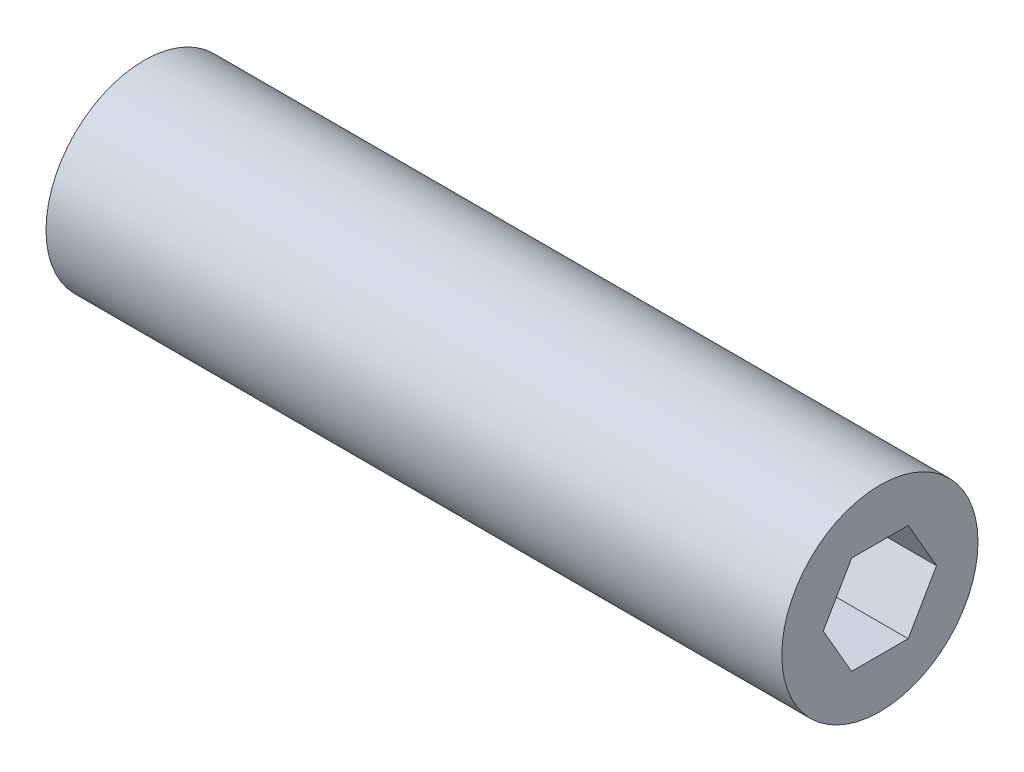
ISO-10303-21;
HEADER;
FILE_DESCRIPTION(('STEP AP214'),'2;1');
FILE_NAME('part.step','',(''),(''),'','','');
FILE_SCHEMA(('AUTOMOTIVE_DESIGN { 1 0 10303 214 1 1 1 1 }'));
ENDSEC;
DATA;
#1=APPLICATION_CONTEXT('core data for automotive mechanical design processes');
#2=APPLICATION_PROTOCOL_DEFINITION('international standard','automotive_design',2000,#1);
#3=PRODUCT_CONTEXT('',#1,'mechanical');
#4=PRODUCT('Part','Part','',(#3));
#5=PRODUCT_RELATED_PRODUCT_CATEGORY('part','',(#4));
#6=PRODUCT_DEFINITION_FORMATION('','',#4);
#7=PRODUCT_DEFINITION_CONTEXT('part definition',#1,'design');
#8=PRODUCT_DEFINITION('design','',#6,#7);
#9=PRODUCT_DEFINITION_SHAPE('','',#8);
#10=(LENGTH_UNIT() NAMED_UNIT(*) SI_UNIT(.MILLI.,.METRE.));
#11=(NAMED_UNIT(*) PLANE_ANGLE_UNIT() SI_UNIT($,.RADIAN.));
#12=(NAMED_UNIT(*) SI_UNIT($,.STERADIAN.) SOLID_ANGLE_UNIT());
#13=UNCERTAINTY_MEASURE_WITH_UNIT(LENGTH_MEASURE(1.E-05),#10,'distance_accuracy_value','');
#14=(GEOMETRIC_REPRESENTATION_CONTEXT(3) GLOBAL_UNCERTAINTY_ASSIGNED_CONTEXT((#13)) GLOBAL_UNIT_ASSIGNED_CONTEXT((#10,
#11,#12)) REPRESENTATION_CONTEXT('',''));
#15=CARTESIAN_POINT('',(0.,0.,0.));
#16=DIRECTION('',(0.,0.,1.));
#17=DIRECTION('',(1.,0.,0.));
#18=AXIS2_PLACEMENT_3D('',#15,#16,#17);
#19=CARTESIAN_POINT('',(60.,0.,0.));
#20=DIRECTION('',(1.,0.,0.));
#21=DIRECTION('',(0.,0.,-1.));
#22=AXIS2_PLACEMENT_3D('',#19,#20,#21);
#23=CYLINDRICAL_SURFACE('',#22,2.);
#24=CARTESIAN_POINT('',(60.,0.,0.));
#25=DIRECTION('',(1.,0.,0.));
#26=DIRECTION('',(0.,0.,-1.));
#27=AXIS2_PLACEMENT_3D('',#24,#25,#26);
#28=CIRCLE('',#27,2.);
#29=CARTESIAN_POINT('',(60.,0.,-2.));
#30=VERTEX_POINT('',#29);
#31=EDGE_CURVE('E11',#30,#30,#28,.T.);
#32=ORIENTED_EDGE('',*,*,#31,.T.);
#33=EDGE_LOOP('',(#32));
#34=FACE_BOUND('',#33,.T.);
#35=CARTESIAN_POINT('',(75.,0.,0.));
#36=DIRECTION('',(1.,0.,0.));
#37=DIRECTION('',(0.,0.,-1.));
#38=AXIS2_PLACEMENT_3D('',#35,#36,#37);
#39=CIRCLE('',#38,2.);
#40=CARTESIAN_POINT('',(75.,0.,-2.));
#41=VERTEX_POINT('',#40);
#42=EDGE_CURVE('E39',#41,#41,#39,.T.);
#43=ORIENTED_EDGE('',*,*,#42,.F.);
#44=EDGE_LOOP('',(#43));
#45=FACE_BOUND('',#44,.T.);
#46=ADVANCED_FACE('F36',(#34,#45),#23,.T.);
#47=CARTESIAN_POINT('',(60.,0.,0.));
#48=DIRECTION('',(1.,0.,0.));
#49=DIRECTION('',(0.,0.,-1.));
#50=AXIS2_PLACEMENT_3D('',#47,#48,#49);
#51=PLANE('',#50);
#52=DIRECTION('',(0.,-0.866025403784439,-0.5));
#53=VECTOR('',#52,1.);
#54=CARTESIAN_POINT('',(60.,0.,1.15470053837925));
#55=LINE('',#54,#53);
#56=CARTESIAN_POINT('',(60.,0.,1.15470053837925));
#57=VERTEX_POINT('',#56);
#58=CARTESIAN_POINT('',(60.,-1.,0.577350269189626));
#59=VERTEX_POINT('',#58);
#60=EDGE_CURVE('E96',#57,#59,#55,.T.);
#61=ORIENTED_EDGE('',*,*,#60,.T.);
#62=DIRECTION('',(0.,0.,-1.));
#63=VECTOR('',#62,1.);
#64=CARTESIAN_POINT('',(60.,-1.,0.577350269189626));
#65=LINE('',#64,#63);
#66=CARTESIAN_POINT('',(60.,-1.,-0.577350269189626));
#67=VERTEX_POINT('',#66);
#68=EDGE_CURVE('E90',#59,#67,#65,.T.);
#69=ORIENTED_EDGE('',*,*,#68,.T.);
#70=DIRECTION('',(0.,0.866025403784439,-0.5));
#71=VECTOR('',#70,1.);
#72=CARTESIAN_POINT('',(60.,-1.,-0.577350269189626));
#73=LINE('',#72,#71);
#74=CARTESIAN_POINT('',(60.,0.,-1.15470053837925));
#75=VERTEX_POINT('',#74);
#76=EDGE_CURVE('E99',#67,#75,#73,.T.);
#77=ORIENTED_EDGE('',*,*,#76,.T.);
#78=DIRECTION('',(0.,0.866025403784439,0.5));
#79=VECTOR('',#78,1.);
#80=CARTESIAN_POINT('',(60.,0.,-1.15470053837925));
#81=LINE('',#80,#79);
#82=CARTESIAN_POINT('',(60.,1.,-0.577350269189625));
#83=VERTEX_POINT('',#82);
#84=EDGE_CURVE('E50',#75,#83,#81,.T.);
#85=ORIENTED_EDGE('',*,*,#84,.T.);
#86=DIRECTION('',(0.,0.,1.));
#87=VECTOR('',#86,1.);
#88=CARTESIAN_POINT('',(60.,1.,-0.577350269189625));
#89=LINE('',#88,#87);
#90=CARTESIAN_POINT('',(60.,1.,0.577350269189626));
#91=VERTEX_POINT('',#90);
#92=EDGE_CURVE('E114',#83,#91,#89,.T.);
#93=ORIENTED_EDGE('',*,*,#92,.T.);
#94=DIRECTION('',(0.,-0.866025403784439,0.5));
#95=VECTOR('',#94,1.);
#96=CARTESIAN_POINT('',(60.,1.,0.577350269189626));
#97=LINE('',#96,#95);
#98=EDGE_CURVE('E117',#91,#57,#97,.T.);
#99=ORIENTED_EDGE('',*,*,#98,.T.);
#100=EDGE_LOOP('',(#61,#69,#77,#85,#93,#99));
#101=FACE_BOUND('',#100,.T.);
#102=ORIENTED_EDGE('',*,*,#31,.F.);
#103=EDGE_LOOP('',(#102));
#104=FACE_BOUND('',#103,.T.);
#105=ADVANCED_FACE('F103',(#101,#104),#51,.F.);
#106=CARTESIAN_POINT('',(75.,0.,0.));
#107=DIRECTION('',(1.,0.,0.));
#108=DIRECTION('',(0.,0.,-1.));
#109=AXIS2_PLACEMENT_3D('',#106,#107,#108);
#110=PLANE('',#109);
#111=DIRECTION('',(0.,0.,-1.));
#112=VECTOR('',#111,1.);
#113=CARTESIAN_POINT('',(75.,-1.,0.577350269189626));
#114=LINE('',#113,#112);
#115=CARTESIAN_POINT('',(75.,-1.,0.577350269189626));
#116=VERTEX_POINT('',#115);
#117=CARTESIAN_POINT('',(75.,-1.,-0.577350269189626));
#118=VERTEX_POINT('',#117);
#119=EDGE_CURVE('E58',#116,#118,#114,.T.);
#120=ORIENTED_EDGE('',*,*,#119,.F.);
#121=DIRECTION('',(0.,-0.866025403784439,-0.5));
#122=VECTOR('',#121,1.);
#123=CARTESIAN_POINT('',(75.,0.,1.15470053837925));
#124=LINE('',#123,#122);
#125=CARTESIAN_POINT('',(75.,0.,1.15470053837925));
#126=VERTEX_POINT('',#125);
#127=EDGE_CURVE('E107',#126,#116,#124,.T.);
#128=ORIENTED_EDGE('',*,*,#127,.F.);
#129=DIRECTION('',(0.,-0.866025403784439,0.5));
#130=VECTOR('',#129,1.);
#131=CARTESIAN_POINT('',(75.,1.,0.577350269189626));
#132=LINE('',#131,#130);
#133=CARTESIAN_POINT('',(75.,1.,0.577350269189626));
#134=VERTEX_POINT('',#133);
#135=EDGE_CURVE('E110',#134,#126,#132,.T.);
#136=ORIENTED_EDGE('',*,*,#135,.F.);
#137=DIRECTION('',(0.,0.,1.));
#138=VECTOR('',#137,1.);
#139=CARTESIAN_POINT('',(75.,1.,-0.577350269189625));
#140=LINE('',#139,#138);
#141=CARTESIAN_POINT('',(75.,1.,-0.577350269189625));
#142=VERTEX_POINT('',#141);
#143=EDGE_CURVE('E126',#142,#134,#140,.T.);
#144=ORIENTED_EDGE('',*,*,#143,.F.);
#145=DIRECTION('',(0.,0.866025403784439,0.5));
#146=VECTOR('',#145,1.);
#147=CARTESIAN_POINT('',(75.,0.,-1.15470053837925));
#148=LINE('',#147,#146);
#149=CARTESIAN_POINT('',(75.,0.,-1.15470053837925));
#150=VERTEX_POINT('',#149);
#151=EDGE_CURVE('E123',#150,#142,#148,.T.);
#152=ORIENTED_EDGE('',*,*,#151,.F.);
#153=DIRECTION('',(0.,0.866025403784439,-0.5));
#154=VECTOR('',#153,1.);
#155=CARTESIAN_POINT('',(75.,-1.,-0.577350269189626));
#156=LINE('',#155,#154);
#157=EDGE_CURVE('E121',#118,#150,#156,.T.);
#158=ORIENTED_EDGE('',*,*,#157,.F.);
#159=EDGE_LOOP('',(#120,#128,#136,#144,#152,#158));
#160=FACE_BOUND('',#159,.T.);
#161=ORIENTED_EDGE('',*,*,#42,.T.);
#162=EDGE_LOOP('',(#161));
#163=FACE_BOUND('',#162,.T.);
#164=ADVANCED_FACE('F143',(#160,#163),#110,.T.);
#165=CARTESIAN_POINT('',(60.,-1.,0.577350269189626));
#166=DIRECTION('',(0.,-1.,0.));
#167=DIRECTION('',(0.,0.,-1.));
#168=AXIS2_PLACEMENT_3D('',#165,#166,#167);
#169=PLANE('',#168);
#170=ORIENTED_EDGE('',*,*,#119,.T.);
#171=DIRECTION('',(1.,0.,0.));
#172=VECTOR('',#171,1.);
#173=CARTESIAN_POINT('',(60.,-1.,-0.577350269189626));
#174=LINE('',#173,#172);
#175=EDGE_CURVE('E86',#67,#118,#174,.T.);
#176=ORIENTED_EDGE('',*,*,#175,.F.);
#177=ORIENTED_EDGE('',*,*,#68,.F.);
#178=DIRECTION('',(1.,0.,0.));
#179=VECTOR('',#178,1.);
#180=CARTESIAN_POINT('',(60.,-1.,0.577350269189626));
#181=LINE('',#180,#179);
#182=EDGE_CURVE('E131',#59,#116,#181,.T.);
#183=ORIENTED_EDGE('',*,*,#182,.T.);
#184=EDGE_LOOP('',(#170,#176,#177,#183));
#185=FACE_BOUND('',#184,.T.);
#186=ADVANCED_FACE('F88',(#185),#169,.F.);
#187=CARTESIAN_POINT('',(60.,0.,1.15470053837925));
#188=DIRECTION('',(0.,-0.5,0.866025403784439));
#189=DIRECTION('',(0.,-0.866025403784439,-0.5));
#190=AXIS2_PLACEMENT_3D('',#187,#188,#189);
#191=PLANE('',#190);
#192=ORIENTED_EDGE('',*,*,#127,.T.);
#193=ORIENTED_EDGE('',*,*,#182,.F.);
#194=ORIENTED_EDGE('',*,*,#60,.F.);
#195=DIRECTION('',(1.,0.,0.));
#196=VECTOR('',#195,1.);
#197=CARTESIAN_POINT('',(60.,0.,1.15470053837925));
#198=LINE('',#197,#196);
#199=EDGE_CURVE('E133',#57,#126,#198,.T.);
#200=ORIENTED_EDGE('',*,*,#199,.T.);
#201=EDGE_LOOP('',(#192,#193,#194,#200));
#202=FACE_BOUND('',#201,.T.);
#203=ADVANCED_FACE('F154',(#202),#191,.F.);
#204=CARTESIAN_POINT('',(60.,1.,0.577350269189626));
#205=DIRECTION('',(0.,0.5,0.866025403784439));
#206=DIRECTION('',(0.,-0.866025403784439,0.5));
#207=AXIS2_PLACEMENT_3D('',#204,#205,#206);
#208=PLANE('',#207);
#209=ORIENTED_EDGE('',*,*,#135,.T.);
#210=ORIENTED_EDGE('',*,*,#199,.F.);
#211=ORIENTED_EDGE('',*,*,#98,.F.);
#212=DIRECTION('',(1.,0.,0.));
#213=VECTOR('',#212,1.);
#214=CARTESIAN_POINT('',(60.,1.,0.577350269189626));
#215=LINE('',#214,#213);
#216=EDGE_CURVE('E135',#91,#134,#215,.T.);
#217=ORIENTED_EDGE('',*,*,#216,.T.);
#218=EDGE_LOOP('',(#209,#210,#211,#217));
#219=FACE_BOUND('',#218,.T.);
#220=ADVANCED_FACE('F152',(#219),#208,.F.);
#221=CARTESIAN_POINT('',(60.,1.,-0.577350269189625));
#222=DIRECTION('',(0.,1.,0.));
#223=DIRECTION('',(0.,0.,1.));
#224=AXIS2_PLACEMENT_3D('',#221,#222,#223);
#225=PLANE('',#224);
#226=ORIENTED_EDGE('',*,*,#143,.T.);
#227=ORIENTED_EDGE('',*,*,#216,.F.);
#228=ORIENTED_EDGE('',*,*,#92,.F.);
#229=DIRECTION('',(1.,0.,0.));
#230=VECTOR('',#229,1.);
#231=CARTESIAN_POINT('',(60.,1.,-0.577350269189625));
#232=LINE('',#231,#230);
#233=EDGE_CURVE('E137',#83,#142,#232,.T.);
#234=ORIENTED_EDGE('',*,*,#233,.T.);
#235=EDGE_LOOP('',(#226,#227,#228,#234));
#236=FACE_BOUND('',#235,.T.);
#237=ADVANCED_FACE('F148',(#236),#225,.F.);
#238=CARTESIAN_POINT('',(60.,0.,-1.15470053837925));
#239=DIRECTION('',(0.,0.5,-0.866025403784439));
#240=DIRECTION('',(0.,0.866025403784439,0.5));
#241=AXIS2_PLACEMENT_3D('',#238,#239,#240);
#242=PLANE('',#241);
#243=ORIENTED_EDGE('',*,*,#151,.T.);
#244=ORIENTED_EDGE('',*,*,#233,.F.);
#245=ORIENTED_EDGE('',*,*,#84,.F.);
#246=DIRECTION('',(1.,0.,0.));
#247=VECTOR('',#246,1.);
#248=CARTESIAN_POINT('',(60.,0.,-1.15470053837925));
#249=LINE('',#248,#247);
#250=EDGE_CURVE('E95',#75,#150,#249,.T.);
#251=ORIENTED_EDGE('',*,*,#250,.T.);
#252=EDGE_LOOP('',(#243,#244,#245,#251));
#253=FACE_BOUND('',#252,.T.);
#254=ADVANCED_FACE('F139',(#253),#242,.F.);
#255=CARTESIAN_POINT('',(60.,-1.,-0.577350269189626));
#256=DIRECTION('',(0.,-0.5,-0.866025403784439));
#257=DIRECTION('',(0.,0.866025403784439,-0.5));
#258=AXIS2_PLACEMENT_3D('',#255,#256,#257);
#259=PLANE('',#258);
#260=ORIENTED_EDGE('',*,*,#157,.T.);
#261=ORIENTED_EDGE('',*,*,#250,.F.);
#262=ORIENTED_EDGE('',*,*,#76,.F.);
#263=ORIENTED_EDGE('',*,*,#175,.T.);
#264=EDGE_LOOP('',(#260,#261,#262,#263));
#265=FACE_BOUND('',#264,.T.);
#266=ADVANCED_FACE('F100',(#265),#259,.F.);
#267=CLOSED_SHELL('',(#46,#105,#164,#186,#203,#220,#237,#254,#266));
#268=MANIFOLD_SOLID_BREP('B2',#267);
#269=ADVANCED_BREP_SHAPE_REPRESENTATION('',(#18,#268),#14);
#270=SHAPE_DEFINITION_REPRESENTATION(#9,#269);
ENDSEC;
END-ISO-10303-21;
